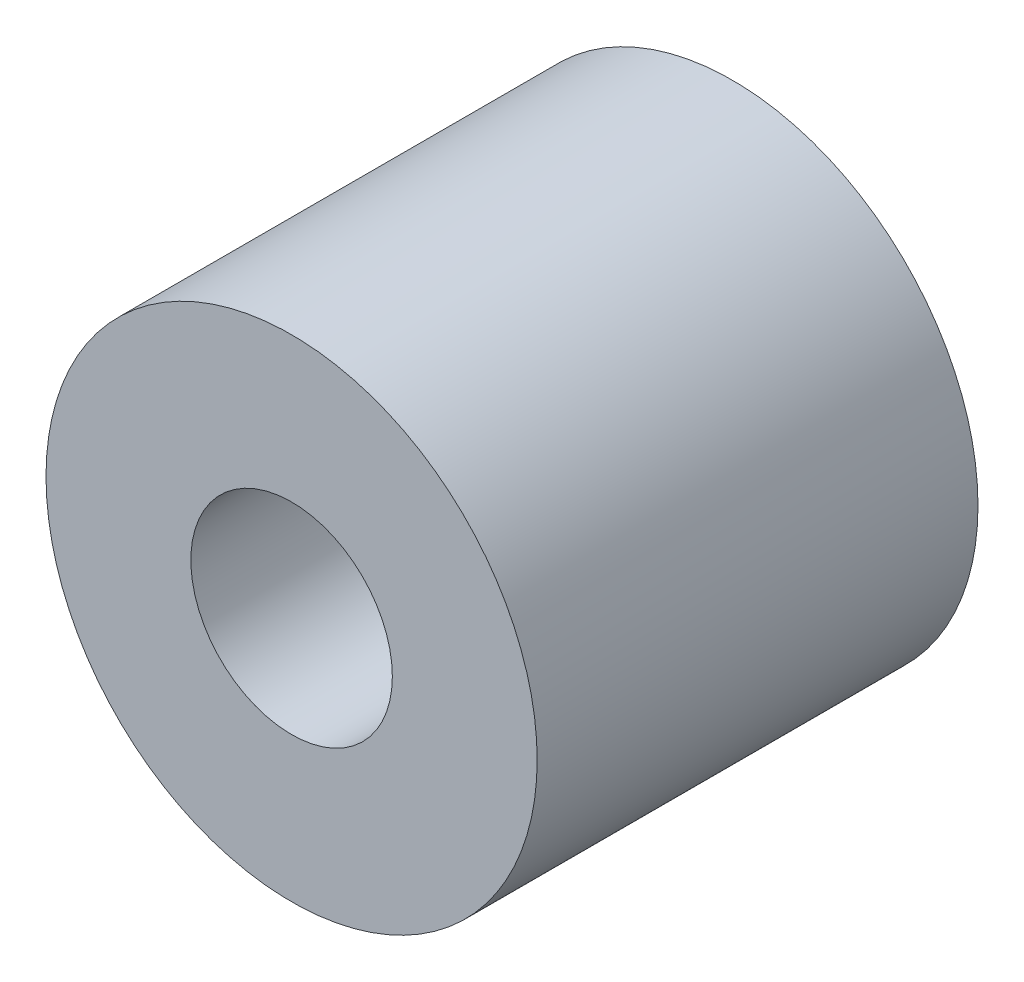
ISO-10303-21;
HEADER;
FILE_DESCRIPTION(('STEP AP214'),'2;1');
FILE_NAME('part.step','',(''),(''),'','','');
FILE_SCHEMA(('AUTOMOTIVE_DESIGN { 1 0 10303 214 1 1 1 1 }'));
ENDSEC;
DATA;
#1=APPLICATION_CONTEXT('core data for automotive mechanical design processes');
#2=APPLICATION_PROTOCOL_DEFINITION('international standard','automotive_design',2000,#1);
#3=PRODUCT_CONTEXT('',#1,'mechanical');
#4=PRODUCT('Part','Part','',(#3));
#5=PRODUCT_RELATED_PRODUCT_CATEGORY('part','',(#4));
#6=PRODUCT_DEFINITION_FORMATION('','',#4);
#7=PRODUCT_DEFINITION_CONTEXT('part definition',#1,'design');
#8=PRODUCT_DEFINITION('design','',#6,#7);
#9=PRODUCT_DEFINITION_SHAPE('','',#8);
#10=(LENGTH_UNIT() NAMED_UNIT(*) SI_UNIT(.MILLI.,.METRE.));
#11=(NAMED_UNIT(*) PLANE_ANGLE_UNIT() SI_UNIT($,.RADIAN.));
#12=(NAMED_UNIT(*) SI_UNIT($,.STERADIAN.) SOLID_ANGLE_UNIT());
#13=UNCERTAINTY_MEASURE_WITH_UNIT(LENGTH_MEASURE(1.E-05),#10,'distance_accuracy_value','');
#14=(GEOMETRIC_REPRESENTATION_CONTEXT(3) GLOBAL_UNCERTAINTY_ASSIGNED_CONTEXT((#13)) GLOBAL_UNIT_ASSIGNED_CONTEXT((#10,
#11,#12)) REPRESENTATION_CONTEXT('',''));
#15=CARTESIAN_POINT('',(0.,0.,0.));
#16=DIRECTION('',(0.,0.,1.));
#17=DIRECTION('',(1.,0.,0.));
#18=AXIS2_PLACEMENT_3D('',#15,#16,#17);
#19=CARTESIAN_POINT('',(0.,0.,7.));
#20=DIRECTION('',(0.,0.,1.));
#21=DIRECTION('',(1.,0.,0.));
#22=AXIS2_PLACEMENT_3D('',#19,#20,#21);
#23=PLANE('',#22);
#24=CARTESIAN_POINT('',(0.,0.,7.));
#25=DIRECTION('',(0.,0.,1.));
#26=DIRECTION('',(1.,0.,0.));
#27=AXIS2_PLACEMENT_3D('',#24,#25,#26);
#28=CIRCLE('',#27,3.9);
#29=CARTESIAN_POINT('',(3.9,0.,7.));
#30=VERTEX_POINT('',#29);
#31=EDGE_CURVE('E10',#30,#30,#28,.T.);
#32=ORIENTED_EDGE('',*,*,#31,.T.);
#33=EDGE_LOOP('',(#32));
#34=FACE_BOUND('',#33,.T.);
#35=CARTESIAN_POINT('',(0.,0.,7.));
#36=DIRECTION('',(0.,0.,1.));
#37=DIRECTION('',(1.,0.,0.));
#38=AXIS2_PLACEMENT_3D('',#35,#36,#37);
#39=CIRCLE('',#38,1.6);
#40=CARTESIAN_POINT('',(1.6,0.,7.));
#41=VERTEX_POINT('',#40);
#42=EDGE_CURVE('E44',#41,#41,#39,.T.);
#43=ORIENTED_EDGE('',*,*,#42,.F.);
#44=EDGE_LOOP('',(#43));
#45=FACE_BOUND('',#44,.T.);
#46=ADVANCED_FACE('F33',(#34,#45),#23,.T.);
#47=CARTESIAN_POINT('',(0.,0.,0.));
#48=DIRECTION('',(0.,0.,1.));
#49=DIRECTION('',(1.,0.,0.));
#50=AXIS2_PLACEMENT_3D('',#47,#48,#49);
#51=PLANE('',#50);
#52=CARTESIAN_POINT('',(0.,0.,0.));
#53=DIRECTION('',(0.,0.,1.));
#54=DIRECTION('',(1.,0.,0.));
#55=AXIS2_PLACEMENT_3D('',#52,#53,#54);
#56=CIRCLE('',#55,3.9);
#57=CARTESIAN_POINT('',(3.9,0.,0.));
#58=VERTEX_POINT('',#57);
#59=EDGE_CURVE('E37',#58,#58,#56,.T.);
#60=ORIENTED_EDGE('',*,*,#59,.F.);
#61=EDGE_LOOP('',(#60));
#62=FACE_BOUND('',#61,.T.);
#63=CARTESIAN_POINT('',(0.,0.,0.));
#64=DIRECTION('',(0.,0.,1.));
#65=DIRECTION('',(1.,0.,0.));
#66=AXIS2_PLACEMENT_3D('',#63,#64,#65);
#67=CIRCLE('',#66,1.6);
#68=CARTESIAN_POINT('',(1.6,0.,0.));
#69=VERTEX_POINT('',#68);
#70=EDGE_CURVE('E46',#69,#69,#67,.T.);
#71=ORIENTED_EDGE('',*,*,#70,.T.);
#72=EDGE_LOOP('',(#71));
#73=FACE_BOUND('',#72,.T.);
#74=ADVANCED_FACE('F56',(#62,#73),#51,.F.);
#75=CARTESIAN_POINT('',(0.,0.,7.));
#76=DIRECTION('',(0.,0.,-1.));
#77=DIRECTION('',(-1.,0.,0.));
#78=AXIS2_PLACEMENT_3D('',#75,#76,#77);
#79=CYLINDRICAL_SURFACE('',#78,3.9);
#80=ORIENTED_EDGE('',*,*,#31,.F.);
#81=EDGE_LOOP('',(#80));
#82=FACE_BOUND('',#81,.T.);
#83=ORIENTED_EDGE('',*,*,#59,.T.);
#84=EDGE_LOOP('',(#83));
#85=FACE_BOUND('',#84,.T.);
#86=ADVANCED_FACE('F35',(#82,#85),#79,.T.);
#87=CARTESIAN_POINT('',(0.,0.,7.));
#88=DIRECTION('',(0.,0.,-1.));
#89=DIRECTION('',(-1.,0.,0.));
#90=AXIS2_PLACEMENT_3D('',#87,#88,#89);
#91=CYLINDRICAL_SURFACE('',#90,1.6);
#92=ORIENTED_EDGE('',*,*,#42,.T.);
#93=EDGE_LOOP('',(#92));
#94=FACE_BOUND('',#93,.T.);
#95=ORIENTED_EDGE('',*,*,#70,.F.);
#96=EDGE_LOOP('',(#95));
#97=FACE_BOUND('',#96,.T.);
#98=ADVANCED_FACE('F52',(#94,#97),#91,.F.);
#99=CLOSED_SHELL('',(#46,#74,#86,#98));
#100=MANIFOLD_SOLID_BREP('B2',#99);
#101=ADVANCED_BREP_SHAPE_REPRESENTATION('',(#18,#100),#14);
#102=SHAPE_DEFINITION_REPRESENTATION(#9,#101);
ENDSEC;
END-ISO-10303-21;
